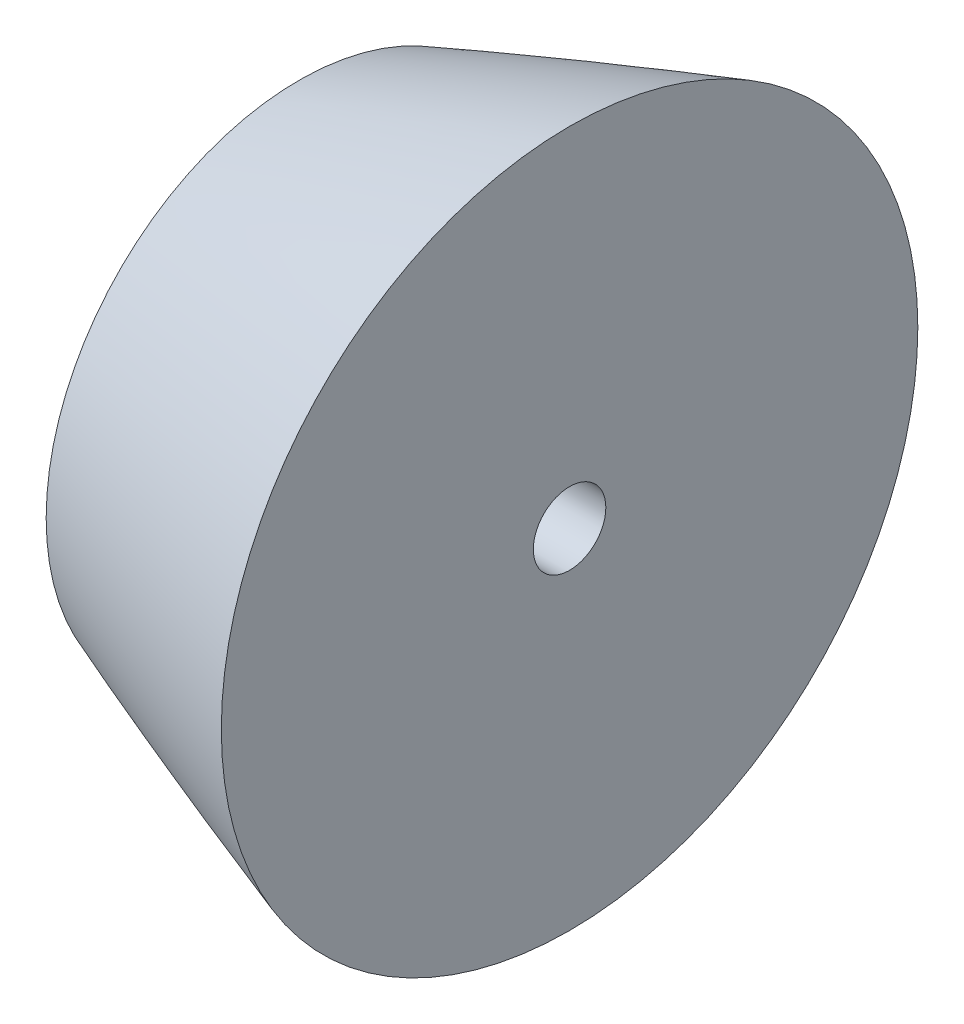
ISO-10303-21;
HEADER;
FILE_DESCRIPTION(('STEP AP214'),'2;1');
FILE_NAME('part.step','',(''),(''),'','','');
FILE_SCHEMA(('AUTOMOTIVE_DESIGN { 1 0 10303 214 1 1 1 1 }'));
ENDSEC;
DATA;
#1=APPLICATION_CONTEXT('core data for automotive mechanical design processes');
#2=APPLICATION_PROTOCOL_DEFINITION('international standard','automotive_design',2000,#1);
#3=PRODUCT_CONTEXT('',#1,'mechanical');
#4=PRODUCT('Part','Part','',(#3));
#5=PRODUCT_RELATED_PRODUCT_CATEGORY('part','',(#4));
#6=PRODUCT_DEFINITION_FORMATION('','',#4);
#7=PRODUCT_DEFINITION_CONTEXT('part definition',#1,'design');
#8=PRODUCT_DEFINITION('design','',#6,#7);
#9=PRODUCT_DEFINITION_SHAPE('','',#8);
#10=(LENGTH_UNIT() NAMED_UNIT(*) SI_UNIT(.MILLI.,.METRE.));
#11=(NAMED_UNIT(*) PLANE_ANGLE_UNIT() SI_UNIT($,.RADIAN.));
#12=(NAMED_UNIT(*) SI_UNIT($,.STERADIAN.) SOLID_ANGLE_UNIT());
#13=UNCERTAINTY_MEASURE_WITH_UNIT(LENGTH_MEASURE(1.E-05),#10,'distance_accuracy_value','');
#14=(GEOMETRIC_REPRESENTATION_CONTEXT(3) GLOBAL_UNCERTAINTY_ASSIGNED_CONTEXT((#13)) GLOBAL_UNIT_ASSIGNED_CONTEXT((#10,
#11,#12)) REPRESENTATION_CONTEXT('',''));
#15=CARTESIAN_POINT('',(0.,0.,0.));
#16=DIRECTION('',(0.,0.,1.));
#17=DIRECTION('',(1.,0.,0.));
#18=AXIS2_PLACEMENT_3D('',#15,#16,#17);
#19=CARTESIAN_POINT('',(0.,0.,0.));
#20=CARTESIAN_POINT('',(0.0022614130654814,0.0125596339292187,0.));
#21=CARTESIAN_POINT('',(0.00822914946442607,0.0372713204909585,0.));
#22=CARTESIAN_POINT('',(0.0261974766944352,0.0850108023949695,0.));
#23=CARTESIAN_POINT('',(0.0705930880654768,0.176725306773919,0.));
#24=CARTESIAN_POINT('',(0.135390601800773,0.284235784533498,0.));
#25=CARTESIAN_POINT('',(0.220401302918571,0.406590083556227,0.));
#26=CARTESIAN_POINT('',(0.336037993188335,0.55654412589075,0.));
#27=CARTESIAN_POINT('',(0.508304998192314,0.760811711331563,0.));
#28=CARTESIAN_POINT('',(0.802086139915245,1.07329374197397,0.));
#29=CARTESIAN_POINT('',(1.3250808544152,1.5651693316744,0.));
#30=CARTESIAN_POINT('',(2.23811863327799,2.31922525640611,0.));
#31=CARTESIAN_POINT('',(3.82527199460683,3.46661844329685,0.));
#32=CARTESIAN_POINT('',(6.61398983168787,5.22529479812376,0.));
#33=CARTESIAN_POINT('',(11.4561201373055,7.87661771124617,0.));
#34=CARTESIAN_POINT('',(19.2936045717849,11.6017464049679,0.));
#35=CARTESIAN_POINT('',(32.6155540983632,17.1304800149878,0.));
#36=CARTESIAN_POINT('',(51.6882713192191,23.9818909953945,0.));
#37=CARTESIAN_POINT('',(75.6130579691869,31.5462124100227,0.));
#38=CARTESIAN_POINT('',(103.310212008121,39.3619752607389,0.));
#39=CARTESIAN_POINT('',(131.892371678201,46.6864265382098,0.));
#40=CARTESIAN_POINT('',(160.614305523739,53.4402971641609,0.));
#41=CARTESIAN_POINT('',(189.448153439503,59.6968672065839,0.));
#42=CARTESIAN_POINT('',(218.376688059264,65.4994445239083,0.));
#43=CARTESIAN_POINT('',(247.387631706865,70.8740216312316,0.));
#44=CARTESIAN_POINT('',(276.472706828754,75.8317963554473,0.));
#45=CARTESIAN_POINT('',(305.625866717163,80.3721875281771,0.));
#46=CARTESIAN_POINT('',(334.843049411104,84.4812168590206,0.));
#47=CARTESIAN_POINT('',(364.121565724,88.1293712678874,0.));
#48=CARTESIAN_POINT('',(389.792768775555,90.8705573634927,0.));
#49=CARTESIAN_POINT('',(411.834102605306,92.8373554171655,0.));
#50=CARTESIAN_POINT('',(428.995077346176,94.0675681736351,0.));
#51=CARTESIAN_POINT('',(440.032338734747,94.6975648897828,0.));
#52=CARTESIAN_POINT('',(448.618051981291,95.0620461420282,0.));
#53=CARTESIAN_POINT('',(453.521410507438,95.2001609428691,0.));
#54=CARTESIAN_POINT('',(455.973700483997,95.2442558624271,0.));
#55=CARTESIAN_POINT('',(457.2,95.249999999816,0.));
#56=B_SPLINE_CURVE_WITH_KNOTS('',4,(#19,#20,#21,#22,#23,#24,#25,#26,#27,#28,#29,#30,#31,#32,#33,
#34,#35,#36,#37,#38,#39,#40,#41,#42,#43,#44,#45,#46,#47,#48,#49,#50,#51,#52,#53,#54,#55),
.UNSPECIFIED.,.F.,.F.,(5,1,1,1,1,1,1,1,1,1,1,1,1,1,1,1,1,1,1,1,1,1,1,1,1,1,1,1,1,1,1,1,1,5),(0.,
0.000108243580788651,0.000216487161577302,0.000432974323154604,0.000865948646309209,
0.00117471485125389,0.00148348105619857,0.00204360380612716,0.00313868485030378,
0.00482152199168749,0.00758803504743745,0.0121115660565557,0.0197907061424975,
0.0328543492589365,0.0545295596156781,0.0859065281731349,0.142462243157027,0.205216411679363,
0.267970587735401,0.330724762524258,0.393478942174771,0.456233117849943,0.518987297782399,
0.58174147420453,0.644495651801916,0.707249831202701,0.7700040110628,0.832758188680063,
0.895512367319852,0.926889456218357,0.958266545116861,0.979133272558431,0.989566636279215,1.),.UNSPECIFIED.);
#57=CARTESIAN_POINT('',(0.,0.,0.));
#58=DIRECTION('',(-1.,0.,0.));
#59=AXIS1_PLACEMENT('',#57,#58);
#60=SURFACE_OF_REVOLUTION('',#56,#59);
#61=CARTESIAN_POINT('',(34.8664916325534,0.,0.));
#62=DIRECTION('',(-1.,0.,0.));
#63=DIRECTION('',(0.,0.,1.));
#64=AXIS2_PLACEMENT_3D('',#61,#62,#63);
#65=CIRCLE('',#64,17.7998571358856);
#66=CARTESIAN_POINT('',(34.8664916325534,0.,17.7998571358856));
#67=VERTEX_POINT('',#66);
#68=EDGE_CURVE('E39',#67,#67,#65,.T.);
#69=ORIENTED_EDGE('',*,*,#68,.F.);
#70=EDGE_LOOP('',(#69));
#71=FACE_BOUND('',#70,.T.);
#72=CARTESIAN_POINT('',(53.9164916325534,0.,0.));
#73=DIRECTION('',(-1.,0.,0.));
#74=DIRECTION('',(0.,0.,1.));
#75=AXIS2_PLACEMENT_3D('',#72,#73,#74);
#76=CIRCLE('',#75,24.5188476331242);
#77=CARTESIAN_POINT('',(53.9164916325534,0.,24.5188476331242));
#78=VERTEX_POINT('',#77);
#79=EDGE_CURVE('E10',#78,#78,#76,.T.);
#80=ORIENTED_EDGE('',*,*,#79,.T.);
#81=EDGE_LOOP('',(#80));
#82=FACE_BOUND('',#81,.T.);
#83=ADVANCED_FACE('F35',(#71,#82),#60,.F.);
#84=CARTESIAN_POINT('',(53.9164916325534,0.,0.));
#85=DIRECTION('',(1.,0.,0.));
#86=DIRECTION('',(0.,0.,-1.));
#87=AXIS2_PLACEMENT_3D('',#84,#85,#86);
#88=PLANE('',#87);
#89=CARTESIAN_POINT('',(53.9164916325534,0.,0.));
#90=DIRECTION('',(1.,0.,0.));
#91=DIRECTION('',(0.,0.,-1.));
#92=AXIS2_PLACEMENT_3D('',#89,#90,#91);
#93=CIRCLE('',#92,2.55269999999999);
#94=CARTESIAN_POINT('',(53.9164916325534,0.,-2.55269999999999));
#95=VERTEX_POINT('',#94);
#96=EDGE_CURVE('E56',#95,#95,#93,.T.);
#97=ORIENTED_EDGE('',*,*,#96,.F.);
#98=EDGE_LOOP('',(#97));
#99=FACE_BOUND('',#98,.T.);
#100=ORIENTED_EDGE('',*,*,#79,.F.);
#101=EDGE_LOOP('',(#100));
#102=FACE_BOUND('',#101,.T.);
#103=ADVANCED_FACE('F62',(#99,#102),#88,.T.);
#104=CARTESIAN_POINT('',(34.8664916325534,0.,0.));
#105=DIRECTION('',(1.,0.,0.));
#106=DIRECTION('',(0.,0.,-1.));
#107=AXIS2_PLACEMENT_3D('',#104,#105,#106);
#108=PLANE('',#107);
#109=CARTESIAN_POINT('',(34.8664916325534,0.,0.));
#110=DIRECTION('',(1.,0.,0.));
#111=DIRECTION('',(0.,0.,-1.));
#112=AXIS2_PLACEMENT_3D('',#109,#110,#111);
#113=CIRCLE('',#112,2.5527);
#114=CARTESIAN_POINT('',(34.8664916325534,0.,-2.5527));
#115=VERTEX_POINT('',#114);
#116=EDGE_CURVE('E46',#115,#115,#113,.T.);
#117=ORIENTED_EDGE('',*,*,#116,.T.);
#118=EDGE_LOOP('',(#117));
#119=FACE_BOUND('',#118,.T.);
#120=ORIENTED_EDGE('',*,*,#68,.T.);
#121=EDGE_LOOP('',(#120));
#122=FACE_BOUND('',#121,.T.);
#123=ADVANCED_FACE('F65',(#119,#122),#108,.F.);
#124=CARTESIAN_POINT('',(53.9164916325534,0.,0.));
#125=DIRECTION('',(1.,0.,0.));
#126=DIRECTION('',(0.,0.,-1.));
#127=AXIS2_PLACEMENT_3D('',#124,#125,#126);
#128=CYLINDRICAL_SURFACE('',#127,2.55269999999999);
#129=ORIENTED_EDGE('',*,*,#116,.F.);
#130=EDGE_LOOP('',(#129));
#131=FACE_BOUND('',#130,.T.);
#132=ORIENTED_EDGE('',*,*,#96,.T.);
#133=EDGE_LOOP('',(#132));
#134=FACE_BOUND('',#133,.T.);
#135=ADVANCED_FACE('F60',(#131,#134),#128,.F.);
#136=CLOSED_SHELL('',(#83,#103,#123,#135));
#137=MANIFOLD_SOLID_BREP('B2',#136);
#138=ADVANCED_BREP_SHAPE_REPRESENTATION('',(#18,#137),#14);
#139=SHAPE_DEFINITION_REPRESENTATION(#9,#138);
ENDSEC;
END-ISO-10303-21;
